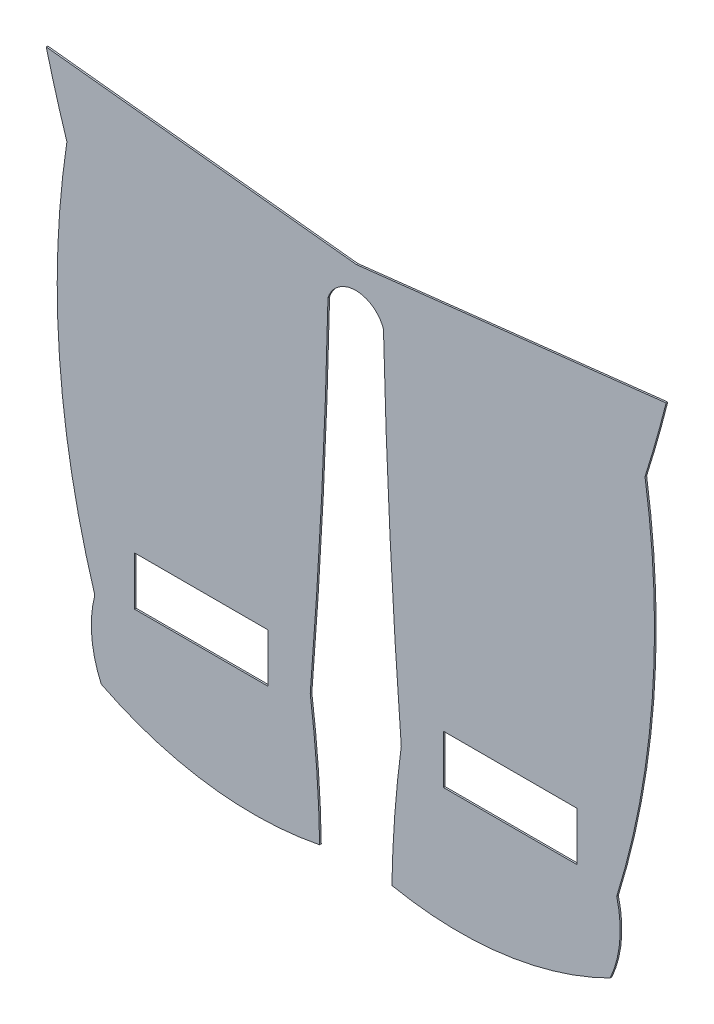
ISO-10303-21;
HEADER;
FILE_DESCRIPTION(('STEP AP214'),'2;1');
FILE_NAME('part.step','',(''),(''),'','','');
FILE_SCHEMA(('AUTOMOTIVE_DESIGN { 1 0 10303 214 1 1 1 1 }'));
ENDSEC;
DATA;
#1=APPLICATION_CONTEXT('core data for automotive mechanical design processes');
#2=APPLICATION_PROTOCOL_DEFINITION('international standard','automotive_design',2000,#1);
#3=PRODUCT_CONTEXT('',#1,'mechanical');
#4=PRODUCT('Part','Part','',(#3));
#5=PRODUCT_RELATED_PRODUCT_CATEGORY('part','',(#4));
#6=PRODUCT_DEFINITION_FORMATION('','',#4);
#7=PRODUCT_DEFINITION_CONTEXT('part definition',#1,'design');
#8=PRODUCT_DEFINITION('design','',#6,#7);
#9=PRODUCT_DEFINITION_SHAPE('','',#8);
#10=(LENGTH_UNIT() NAMED_UNIT(*) SI_UNIT(.MILLI.,.METRE.));
#11=(NAMED_UNIT(*) PLANE_ANGLE_UNIT() SI_UNIT($,.RADIAN.));
#12=(NAMED_UNIT(*) SI_UNIT($,.STERADIAN.) SOLID_ANGLE_UNIT());
#13=UNCERTAINTY_MEASURE_WITH_UNIT(LENGTH_MEASURE(1.E-05),#10,'distance_accuracy_value','');
#14=(GEOMETRIC_REPRESENTATION_CONTEXT(3) GLOBAL_UNCERTAINTY_ASSIGNED_CONTEXT((#13)) GLOBAL_UNIT_ASSIGNED_CONTEXT((#10,
#11,#12)) REPRESENTATION_CONTEXT('',''));
#15=CARTESIAN_POINT('',(0.,0.,0.));
#16=DIRECTION('',(0.,0.,1.));
#17=DIRECTION('',(1.,0.,0.));
#18=AXIS2_PLACEMENT_3D('',#15,#16,#17);
#19=CARTESIAN_POINT('',(107.513003913348,-30.1218571885523,0.1));
#20=DIRECTION('',(0.,0.,1.));
#21=DIRECTION('',(1.,0.,0.));
#22=AXIS2_PLACEMENT_3D('',#19,#20,#21);
#23=PLANE('',#22);
#24=CARTESIAN_POINT('',(107.513003913348,-30.1218571885523,0.1));
#25=DIRECTION('',(0.,0.,1.));
#26=DIRECTION('',(1.,0.,0.));
#27=AXIS2_PLACEMENT_3D('',#24,#25,#26);
#28=CIRCLE('',#27,67.2087371962393);
#29=CARTESIAN_POINT('',(40.8915086534505,-21.2567161942628,0.1));
#30=VERTEX_POINT('',#29);
#31=CARTESIAN_POINT('',(40.3143128244383,-28.9598453768816,0.1));
#32=VERTEX_POINT('',#31);
#33=EDGE_CURVE('E255',#30,#32,#28,.T.);
#34=ORIENTED_EDGE('',*,*,#33,.T.);
#35=CARTESIAN_POINT('',(44.4432126529051,-8.62989328623254,0.1));
#36=DIRECTION('',(0.,0.,1.));
#37=DIRECTION('',(1.,0.,0.));
#38=AXIS2_PLACEMENT_3D('',#35,#36,#37);
#39=CIRCLE('',#38,20.7449937527491);
#40=CARTESIAN_POINT('',(53.7414393050201,-27.1743735142545,0.1));
#41=VERTEX_POINT('',#40);
#42=EDGE_CURVE('E258',#32,#41,#39,.T.);
#43=ORIENTED_EDGE('',*,*,#42,.T.);
#44=CARTESIAN_POINT('',(47.442155933447,-24.3281402727975,0.1));
#45=DIRECTION('',(0.,0.,1.));
#46=DIRECTION('',(1.,0.,0.));
#47=AXIS2_PLACEMENT_3D('',#44,#45,#46);
#48=CIRCLE('',#47,6.91245359189859);
#49=CARTESIAN_POINT('',(54.1415674137631,-22.6252308572496,0.1));
#50=VERTEX_POINT('',#49);
#51=EDGE_CURVE('E261',#41,#50,#48,.T.);
#52=ORIENTED_EDGE('',*,*,#51,.T.);
#53=CARTESIAN_POINT('',(4.16295016537832,-7.20259593469375,0.1));
#54=DIRECTION('',(0.,0.,1.));
#55=DIRECTION('',(1.,0.,0.));
#56=AXIS2_PLACEMENT_3D('',#53,#54,#55);
#57=CIRCLE('',#56,52.3041093033327);
#58=CARTESIAN_POINT('',(55.8820234086865,0.598513785615588,0.1));
#59=VERTEX_POINT('',#58);
#60=EDGE_CURVE('E263',#50,#59,#57,.T.);
#61=ORIENTED_EDGE('',*,*,#60,.T.);
#62=CARTESIAN_POINT('',(-22.2255408120811,25.2302523238041,0.1));
#63=DIRECTION('',(0.,0.,1.));
#64=DIRECTION('',(1.,0.,0.));
#65=AXIS2_PLACEMENT_3D('',#62,#63,#64);
#66=CIRCLE('',#65,81.8994147226646);
#67=CARTESIAN_POINT('',(57.1799278092227,5.17319159831001,0.1));
#68=VERTEX_POINT('',#67);
#69=EDGE_CURVE('E265',#59,#68,#66,.T.);
#70=ORIENTED_EDGE('',*,*,#69,.T.);
#71=DIRECTION('',(-0.993663723846832,-0.11239396741305,0.));
#72=VECTOR('',#71,1.);
#73=CARTESIAN_POINT('',(38.1333314379311,3.01881836266757,0.1));
#74=LINE('',#73,#72);
#75=CARTESIAN_POINT('',(38.1333314379311,3.01881836266757,0.1));
#76=VERTEX_POINT('',#75);
#77=EDGE_CURVE('E267',#68,#76,#74,.T.);
#78=ORIENTED_EDGE('',*,*,#77,.T.);
#79=DIRECTION('',(-0.994255428706461,0.107033370907073,0.));
#80=VECTOR('',#79,1.);
#81=CARTESIAN_POINT('',(19.0574821392629,5.07236757587945,0.1));
#82=LINE('',#81,#80);
#83=CARTESIAN_POINT('',(19.0574821392629,5.07236757587945,0.1));
#84=VERTEX_POINT('',#83);
#85=EDGE_CURVE('E269',#76,#84,#82,.T.);
#86=ORIENTED_EDGE('',*,*,#85,.T.);
#87=CARTESIAN_POINT('',(89.8499317339794,23.0606719048557,0.1));
#88=DIRECTION('',(0.,0.,1.));
#89=DIRECTION('',(1.,0.,0.));
#90=AXIS2_PLACEMENT_3D('',#87,#88,#89);
#91=CIRCLE('',#90,73.0421112253223);
#92=CARTESIAN_POINT('',(20.3281128591151,0.658290054192934,0.1));
#93=VERTEX_POINT('',#92);
#94=EDGE_CURVE('E271',#84,#93,#91,.T.);
#95=ORIENTED_EDGE('',*,*,#94,.T.);
#96=CARTESIAN_POINT('',(72.170078260082,-7.23106685208995,0.1));
#97=DIRECTION('',(0.,0.,1.));
#98=DIRECTION('',(1.,0.,0.));
#99=AXIS2_PLACEMENT_3D('',#96,#97,#98);
#100=CIRCLE('',#99,52.4388341692468);
#101=CARTESIAN_POINT('',(22.0424441582349,-22.6275478909864,0.1));
#102=VERTEX_POINT('',#101);
#103=EDGE_CURVE('E273',#93,#102,#100,.T.);
#104=ORIENTED_EDGE('',*,*,#103,.T.);
#105=CARTESIAN_POINT('',(28.7419382651735,-24.3295044845207,0.1));
#106=DIRECTION('',(0.,0.,1.));
#107=DIRECTION('',(1.,0.,0.));
#108=AXIS2_PLACEMENT_3D('',#105,#106,#107);
#109=CIRCLE('',#108,6.9122990050475);
#110=CARTESIAN_POINT('',(22.4431844450191,-27.1765341380844,0.1));
#111=VERTEX_POINT('',#110);
#112=EDGE_CURVE('E275',#102,#111,#109,.T.);
#113=ORIENTED_EDGE('',*,*,#112,.T.);
#114=CARTESIAN_POINT('',(31.8198731199193,-8.67160303052282,0.1));
#115=DIRECTION('',(0.,0.,1.));
#116=DIRECTION('',(1.,0.,0.));
#117=AXIS2_PLACEMENT_3D('',#114,#115,#116);
#118=CIRCLE('',#117,20.7449937527491);
#119=CARTESIAN_POINT('',(35.8714351392091,-29.0171089471976,0.1));
#120=VERTEX_POINT('',#119);
#121=EDGE_CURVE('E277',#111,#120,#118,.T.);
#122=ORIENTED_EDGE('',*,*,#121,.T.);
#123=CARTESIAN_POINT('',(-31.3276129714269,-30.1309294972006,0.1));
#124=DIRECTION('',(0.,0.,1.));
#125=DIRECTION('',(1.,0.,0.));
#126=AXIS2_PLACEMENT_3D('',#123,#124,#125);
#127=CIRCLE('',#126,67.2082782341073);
#128=CARTESIAN_POINT('',(35.292291091325,-21.2573143453631,0.1));
#129=VERTEX_POINT('',#128);
#130=EDGE_CURVE('E279',#120,#129,#127,.T.);
#131=ORIENTED_EDGE('',*,*,#130,.T.);
#132=CARTESIAN_POINT('',(-340.455747322751,8.53305658808496,0.1));
#133=DIRECTION('',(0.,0.,1.));
#134=DIRECTION('',(1.,0.,0.));
#135=AXIS2_PLACEMENT_3D('',#132,#133,#134);
#136=CIRCLE('',#135,376.927121035855);
#137=CARTESIAN_POINT('',(36.3831503836232,0.378318834904858,0.1));
#138=VERTEX_POINT('',#137);
#139=EDGE_CURVE('E281',#129,#138,#136,.T.);
#140=ORIENTED_EDGE('',*,*,#139,.T.);
#141=CARTESIAN_POINT('',(38.0958401757753,-0.179200821452936,0.1));
#142=DIRECTION('',(0.,0.,-1.));
#143=DIRECTION('',(1.,0.,0.));
#144=AXIS2_PLACEMENT_3D('',#141,#142,#143);
#145=CIRCLE('',#144,1.80114810367375);
#146=CARTESIAN_POINT('',(39.796709943411,0.413400667669931,0.1));
#147=VERTEX_POINT('',#146);
#148=EDGE_CURVE('E283',#138,#147,#145,.T.);
#149=ORIENTED_EDGE('',*,*,#148,.T.);
#150=CARTESIAN_POINT('',(446.109151641794,10.0780491726186,0.1));
#151=DIRECTION('',(0.,0.,1.));
#152=DIRECTION('',(1.,0.,0.));
#153=AXIS2_PLACEMENT_3D('',#150,#151,#152);
#154=CIRCLE('',#153,406.427368307828);
#155=EDGE_CURVE('E285',#147,#30,#154,.T.);
#156=ORIENTED_EDGE('',*,*,#155,.T.);
#157=EDGE_LOOP('',(#34,#43,#52,#61,#70,#78,#86,#95,#104,#113,#122,#131,#140,#149,#156));
#158=FACE_BOUND('',#157,.T.);
#159=DIRECTION('',(-1.,0.,0.));
#160=VECTOR('',#159,1.);
#161=CARTESIAN_POINT('',(24.4900417797415,-19.1572976719763,0.1));
#162=LINE('',#161,#160);
#163=CARTESIAN_POINT('',(32.6900417797415,-19.1572976719763,0.1));
#164=VERTEX_POINT('',#163);
#165=CARTESIAN_POINT('',(24.4900417797415,-19.1572976719763,0.1));
#166=VERTEX_POINT('',#165);
#167=EDGE_CURVE('E226',#164,#166,#162,.T.);
#168=ORIENTED_EDGE('',*,*,#167,.F.);
#169=DIRECTION('',(0.,1.,0.));
#170=VECTOR('',#169,1.);
#171=CARTESIAN_POINT('',(32.6900417797415,-19.1572976719763,0.1));
#172=LINE('',#171,#170);
#173=CARTESIAN_POINT('',(32.6900417797415,-22.1572976719763,0.1));
#174=VERTEX_POINT('',#173);
#175=EDGE_CURVE('E224',#174,#164,#172,.T.);
#176=ORIENTED_EDGE('',*,*,#175,.F.);
#177=DIRECTION('',(1.,0.,0.));
#178=VECTOR('',#177,1.);
#179=CARTESIAN_POINT('',(32.6900417797415,-22.1572976719763,0.1));
#180=LINE('',#179,#178);
#181=CARTESIAN_POINT('',(24.4900417797416,-22.1572976719763,0.1));
#182=VERTEX_POINT('',#181);
#183=EDGE_CURVE('E232',#182,#174,#180,.T.);
#184=ORIENTED_EDGE('',*,*,#183,.F.);
#185=DIRECTION('',(0.,-1.,0.));
#186=VECTOR('',#185,1.);
#187=CARTESIAN_POINT('',(24.4900417797415,-22.1572976719763,0.1));
#188=LINE('',#187,#186);
#189=EDGE_CURVE('E229',#166,#182,#188,.T.);
#190=ORIENTED_EDGE('',*,*,#189,.F.);
#191=EDGE_LOOP('',(#168,#176,#184,#190));
#192=FACE_BOUND('',#191,.T.);
#193=DIRECTION('',(-1.,0.,0.));
#194=VECTOR('',#193,1.);
#195=CARTESIAN_POINT('',(43.4900417797416,-19.1572976719763,0.1));
#196=LINE('',#195,#194);
#197=CARTESIAN_POINT('',(51.6900417797415,-19.1572976719763,0.1));
#198=VERTEX_POINT('',#197);
#199=CARTESIAN_POINT('',(43.4900417797416,-19.1572976719763,0.1));
#200=VERTEX_POINT('',#199);
#201=EDGE_CURVE('E196',#198,#200,#196,.T.);
#202=ORIENTED_EDGE('',*,*,#201,.F.);
#203=DIRECTION('',(0.,1.,0.));
#204=VECTOR('',#203,1.);
#205=CARTESIAN_POINT('',(51.6900417797415,-19.1572976719763,0.1));
#206=LINE('',#205,#204);
#207=CARTESIAN_POINT('',(51.6900417797415,-22.1572976719763,0.1));
#208=VERTEX_POINT('',#207);
#209=EDGE_CURVE('E188',#208,#198,#206,.T.);
#210=ORIENTED_EDGE('',*,*,#209,.F.);
#211=DIRECTION('',(1.,0.,0.));
#212=VECTOR('',#211,1.);
#213=CARTESIAN_POINT('',(51.6900417797415,-22.1572976719763,0.1));
#214=LINE('',#213,#212);
#215=CARTESIAN_POINT('',(43.4900417797416,-22.1572976719763,0.1));
#216=VERTEX_POINT('',#215);
#217=EDGE_CURVE('E210',#216,#208,#214,.T.);
#218=ORIENTED_EDGE('',*,*,#217,.F.);
#219=DIRECTION('',(0.,-1.,0.));
#220=VECTOR('',#219,1.);
#221=CARTESIAN_POINT('',(43.4900417797416,-22.1572976719763,0.1));
#222=LINE('',#221,#220);
#223=EDGE_CURVE('E208',#200,#216,#222,.T.);
#224=ORIENTED_EDGE('',*,*,#223,.F.);
#225=EDGE_LOOP('',(#202,#210,#218,#224));
#226=FACE_BOUND('',#225,.T.);
#227=ADVANCED_FACE('F33',(#158,#192,#226),#23,.T.);
#228=CARTESIAN_POINT('',(107.513003913348,-30.1218571885523,0.));
#229=DIRECTION('',(0.,0.,1.));
#230=DIRECTION('',(1.,0.,0.));
#231=AXIS2_PLACEMENT_3D('',#228,#229,#230);
#232=PLANE('',#231);
#233=DIRECTION('',(0.,1.,0.));
#234=VECTOR('',#233,1.);
#235=CARTESIAN_POINT('',(32.6900417797415,-19.1572976719763,0.));
#236=LINE('',#235,#234);
#237=CARTESIAN_POINT('',(32.6900417797415,-22.1572976719763,0.));
#238=VERTEX_POINT('',#237);
#239=CARTESIAN_POINT('',(32.6900417797415,-19.1572976719763,0.));
#240=VERTEX_POINT('',#239);
#241=EDGE_CURVE('E204',#238,#240,#236,.T.);
#242=ORIENTED_EDGE('',*,*,#241,.T.);
#243=DIRECTION('',(-1.,0.,0.));
#244=VECTOR('',#243,1.);
#245=CARTESIAN_POINT('',(24.4900417797415,-19.1572976719763,0.));
#246=LINE('',#245,#244);
#247=CARTESIAN_POINT('',(24.4900417797415,-19.1572976719763,0.));
#248=VERTEX_POINT('',#247);
#249=EDGE_CURVE('E237',#240,#248,#246,.T.);
#250=ORIENTED_EDGE('',*,*,#249,.T.);
#251=DIRECTION('',(0.,-1.,0.));
#252=VECTOR('',#251,1.);
#253=CARTESIAN_POINT('',(24.4900417797415,-22.1572976719763,0.));
#254=LINE('',#253,#252);
#255=CARTESIAN_POINT('',(24.4900417797415,-22.1572976719763,0.));
#256=VERTEX_POINT('',#255);
#257=EDGE_CURVE('E240',#248,#256,#254,.T.);
#258=ORIENTED_EDGE('',*,*,#257,.T.);
#259=DIRECTION('',(1.,0.,0.));
#260=VECTOR('',#259,1.);
#261=CARTESIAN_POINT('',(32.6900417797415,-22.1572976719763,0.));
#262=LINE('',#261,#260);
#263=EDGE_CURVE('E227',#256,#238,#262,.T.);
#264=ORIENTED_EDGE('',*,*,#263,.T.);
#265=EDGE_LOOP('',(#242,#250,#258,#264));
#266=FACE_BOUND('',#265,.T.);
#267=CARTESIAN_POINT('',(107.513003913348,-30.1218571885523,0.));
#268=DIRECTION('',(0.,0.,1.));
#269=DIRECTION('',(1.,0.,0.));
#270=AXIS2_PLACEMENT_3D('',#267,#268,#269);
#271=CIRCLE('',#270,67.2087371962393);
#272=CARTESIAN_POINT('',(40.8915086534505,-21.2567161942628,0.));
#273=VERTEX_POINT('',#272);
#274=CARTESIAN_POINT('',(40.3143128244383,-28.9598453768816,0.));
#275=VERTEX_POINT('',#274);
#276=EDGE_CURVE('E254',#273,#275,#271,.T.);
#277=ORIENTED_EDGE('',*,*,#276,.F.);
#278=CARTESIAN_POINT('',(446.109151641794,10.0780491726186,0.));
#279=DIRECTION('',(0.,0.,1.));
#280=DIRECTION('',(1.,0.,0.));
#281=AXIS2_PLACEMENT_3D('',#278,#279,#280);
#282=CIRCLE('',#281,406.427368307828);
#283=CARTESIAN_POINT('',(39.796709943411,0.413400667669931,0.));
#284=VERTEX_POINT('',#283);
#285=EDGE_CURVE('E259',#284,#273,#282,.T.);
#286=ORIENTED_EDGE('',*,*,#285,.F.);
#287=CARTESIAN_POINT('',(38.0958401757753,-0.179200821452936,0.));
#288=DIRECTION('',(0.,0.,-1.));
#289=DIRECTION('',(1.,0.,0.));
#290=AXIS2_PLACEMENT_3D('',#287,#288,#289);
#291=CIRCLE('',#290,1.80114810367375);
#292=CARTESIAN_POINT('',(36.3831503836232,0.378318834904858,0.));
#293=VERTEX_POINT('',#292);
#294=EDGE_CURVE('E314',#293,#284,#291,.T.);
#295=ORIENTED_EDGE('',*,*,#294,.F.);
#296=CARTESIAN_POINT('',(-340.455747322751,8.53305658808496,0.));
#297=DIRECTION('',(0.,0.,1.));
#298=DIRECTION('',(1.,0.,0.));
#299=AXIS2_PLACEMENT_3D('',#296,#297,#298);
#300=CIRCLE('',#299,376.927121035855);
#301=CARTESIAN_POINT('',(35.292291091325,-21.2573143453631,0.));
#302=VERTEX_POINT('',#301);
#303=EDGE_CURVE('E312',#302,#293,#300,.T.);
#304=ORIENTED_EDGE('',*,*,#303,.F.);
#305=CARTESIAN_POINT('',(-31.3276129714269,-30.1309294972006,0.));
#306=DIRECTION('',(0.,0.,1.));
#307=DIRECTION('',(1.,0.,0.));
#308=AXIS2_PLACEMENT_3D('',#305,#306,#307);
#309=CIRCLE('',#308,67.2082782341073);
#310=CARTESIAN_POINT('',(35.8714351392091,-29.0171089471976,0.));
#311=VERTEX_POINT('',#310);
#312=EDGE_CURVE('E310',#311,#302,#309,.T.);
#313=ORIENTED_EDGE('',*,*,#312,.F.);
#314=CARTESIAN_POINT('',(31.8198731199193,-8.67160303052282,0.));
#315=DIRECTION('',(0.,0.,1.));
#316=DIRECTION('',(1.,0.,0.));
#317=AXIS2_PLACEMENT_3D('',#314,#315,#316);
#318=CIRCLE('',#317,20.7449937527491);
#319=CARTESIAN_POINT('',(22.4431844450191,-27.1765341380844,0.));
#320=VERTEX_POINT('',#319);
#321=EDGE_CURVE('E308',#320,#311,#318,.T.);
#322=ORIENTED_EDGE('',*,*,#321,.F.);
#323=CARTESIAN_POINT('',(28.7419382651735,-24.3295044845207,0.));
#324=DIRECTION('',(0.,0.,1.));
#325=DIRECTION('',(1.,0.,0.));
#326=AXIS2_PLACEMENT_3D('',#323,#324,#325);
#327=CIRCLE('',#326,6.9122990050475);
#328=CARTESIAN_POINT('',(22.0424441582349,-22.6275478909864,0.));
#329=VERTEX_POINT('',#328);
#330=EDGE_CURVE('E306',#329,#320,#327,.T.);
#331=ORIENTED_EDGE('',*,*,#330,.F.);
#332=CARTESIAN_POINT('',(72.170078260082,-7.23106685208995,0.));
#333=DIRECTION('',(0.,0.,1.));
#334=DIRECTION('',(1.,0.,0.));
#335=AXIS2_PLACEMENT_3D('',#332,#333,#334);
#336=CIRCLE('',#335,52.4388341692468);
#337=CARTESIAN_POINT('',(20.3281128591151,0.658290054192934,0.));
#338=VERTEX_POINT('',#337);
#339=EDGE_CURVE('E304',#338,#329,#336,.T.);
#340=ORIENTED_EDGE('',*,*,#339,.F.);
#341=CARTESIAN_POINT('',(89.8499317339794,23.0606719048557,0.));
#342=DIRECTION('',(0.,0.,1.));
#343=DIRECTION('',(1.,0.,0.));
#344=AXIS2_PLACEMENT_3D('',#341,#342,#343);
#345=CIRCLE('',#344,73.0421112253223);
#346=CARTESIAN_POINT('',(19.0574821392629,5.07236757587945,0.));
#347=VERTEX_POINT('',#346);
#348=EDGE_CURVE('E302',#347,#338,#345,.T.);
#349=ORIENTED_EDGE('',*,*,#348,.F.);
#350=DIRECTION('',(-0.994255428706461,0.107033370907073,0.));
#351=VECTOR('',#350,1.);
#352=CARTESIAN_POINT('',(19.0574821392629,5.07236757587945,0.));
#353=LINE('',#352,#351);
#354=CARTESIAN_POINT('',(38.1333314379311,3.01881836266757,0.));
#355=VERTEX_POINT('',#354);
#356=EDGE_CURVE('E300',#355,#347,#353,.T.);
#357=ORIENTED_EDGE('',*,*,#356,.F.);
#358=DIRECTION('',(-0.993663723846832,-0.11239396741305,0.));
#359=VECTOR('',#358,1.);
#360=CARTESIAN_POINT('',(38.1333314379311,3.01881836266757,0.));
#361=LINE('',#360,#359);
#362=CARTESIAN_POINT('',(57.1799278092227,5.17319159831001,0.));
#363=VERTEX_POINT('',#362);
#364=EDGE_CURVE('E298',#363,#355,#361,.T.);
#365=ORIENTED_EDGE('',*,*,#364,.F.);
#366=CARTESIAN_POINT('',(-22.2255408120811,25.2302523238041,0.));
#367=DIRECTION('',(0.,0.,1.));
#368=DIRECTION('',(1.,0.,0.));
#369=AXIS2_PLACEMENT_3D('',#366,#367,#368);
#370=CIRCLE('',#369,81.8994147226646);
#371=CARTESIAN_POINT('',(55.8820234086865,0.598513785615588,0.));
#372=VERTEX_POINT('',#371);
#373=EDGE_CURVE('E296',#372,#363,#370,.T.);
#374=ORIENTED_EDGE('',*,*,#373,.F.);
#375=CARTESIAN_POINT('',(4.16295016537832,-7.20259593469375,0.));
#376=DIRECTION('',(0.,0.,1.));
#377=DIRECTION('',(1.,0.,0.));
#378=AXIS2_PLACEMENT_3D('',#375,#376,#377);
#379=CIRCLE('',#378,52.3041093033327);
#380=CARTESIAN_POINT('',(54.1415674137631,-22.6252308572496,0.));
#381=VERTEX_POINT('',#380);
#382=EDGE_CURVE('E294',#381,#372,#379,.T.);
#383=ORIENTED_EDGE('',*,*,#382,.F.);
#384=CARTESIAN_POINT('',(47.442155933447,-24.3281402727975,0.));
#385=DIRECTION('',(0.,0.,1.));
#386=DIRECTION('',(1.,0.,0.));
#387=AXIS2_PLACEMENT_3D('',#384,#385,#386);
#388=CIRCLE('',#387,6.91245359189859);
#389=CARTESIAN_POINT('',(53.7414393050201,-27.1743735142545,0.));
#390=VERTEX_POINT('',#389);
#391=EDGE_CURVE('E292',#390,#381,#388,.T.);
#392=ORIENTED_EDGE('',*,*,#391,.F.);
#393=CARTESIAN_POINT('',(44.4432126529051,-8.62989328623254,0.));
#394=DIRECTION('',(0.,0.,1.));
#395=DIRECTION('',(1.,0.,0.));
#396=AXIS2_PLACEMENT_3D('',#393,#394,#395);
#397=CIRCLE('',#396,20.7449937527491);
#398=EDGE_CURVE('E290',#275,#390,#397,.T.);
#399=ORIENTED_EDGE('',*,*,#398,.F.);
#400=EDGE_LOOP('',(#277,#286,#295,#304,#313,#322,#331,#340,#349,#357,#365,#374,#383,#392,#399));
#401=FACE_BOUND('',#400,.T.);
#402=DIRECTION('',(0.,1.,0.));
#403=VECTOR('',#402,1.);
#404=CARTESIAN_POINT('',(51.6900417797415,-19.1572976719763,0.));
#405=LINE('',#404,#403);
#406=CARTESIAN_POINT('',(51.6900417797415,-22.1572976719763,0.));
#407=VERTEX_POINT('',#406);
#408=CARTESIAN_POINT('',(51.6900417797415,-19.1572976719763,0.));
#409=VERTEX_POINT('',#408);
#410=EDGE_CURVE('E56',#407,#409,#405,.T.);
#411=ORIENTED_EDGE('',*,*,#410,.T.);
#412=DIRECTION('',(-1.,0.,0.));
#413=VECTOR('',#412,1.);
#414=CARTESIAN_POINT('',(43.4900417797416,-19.1572976719763,0.));
#415=LINE('',#414,#413);
#416=CARTESIAN_POINT('',(43.4900417797416,-19.1572976719763,0.));
#417=VERTEX_POINT('',#416);
#418=EDGE_CURVE('E203',#409,#417,#415,.T.);
#419=ORIENTED_EDGE('',*,*,#418,.T.);
#420=DIRECTION('',(0.,-1.,0.));
#421=VECTOR('',#420,1.);
#422=CARTESIAN_POINT('',(43.4900417797416,-22.1572976719763,0.));
#423=LINE('',#422,#421);
#424=CARTESIAN_POINT('',(43.4900417797416,-22.1572976719763,0.));
#425=VERTEX_POINT('',#424);
#426=EDGE_CURVE('E216',#417,#425,#423,.T.);
#427=ORIENTED_EDGE('',*,*,#426,.T.);
#428=DIRECTION('',(1.,0.,0.));
#429=VECTOR('',#428,1.);
#430=CARTESIAN_POINT('',(51.6900417797415,-22.1572976719763,0.));
#431=LINE('',#430,#429);
#432=EDGE_CURVE('E197',#425,#407,#431,.T.);
#433=ORIENTED_EDGE('',*,*,#432,.T.);
#434=EDGE_LOOP('',(#411,#419,#427,#433));
#435=FACE_BOUND('',#434,.T.);
#436=ADVANCED_FACE('F365',(#266,#401,#435),#232,.F.);
#437=CARTESIAN_POINT('',(107.513003913348,-30.1218571885523,0.1));
#438=DIRECTION('',(0.,0.,-1.));
#439=DIRECTION('',(-1.,0.,0.));
#440=AXIS2_PLACEMENT_3D('',#437,#438,#439);
#441=CYLINDRICAL_SURFACE('',#440,67.2087371962393);
#442=ORIENTED_EDGE('',*,*,#276,.T.);
#443=DIRECTION('',(0.,0.,-1.));
#444=VECTOR('',#443,1.);
#445=CARTESIAN_POINT('',(40.3143128244383,-28.9598453768816,0.1));
#446=LINE('',#445,#444);
#447=EDGE_CURVE('E11',#32,#275,#446,.T.);
#448=ORIENTED_EDGE('',*,*,#447,.F.);
#449=ORIENTED_EDGE('',*,*,#33,.F.);
#450=DIRECTION('',(0.,0.,-1.));
#451=VECTOR('',#450,1.);
#452=CARTESIAN_POINT('',(40.8915086534505,-21.2567161942628,0.1));
#453=LINE('',#452,#451);
#454=EDGE_CURVE('E287',#30,#273,#453,.T.);
#455=ORIENTED_EDGE('',*,*,#454,.T.);
#456=EDGE_LOOP('',(#442,#448,#449,#455));
#457=FACE_BOUND('',#456,.T.);
#458=ADVANCED_FACE('F35',(#457),#441,.T.);
#459=CARTESIAN_POINT('',(44.4432126529051,-8.62989328623254,0.1));
#460=DIRECTION('',(0.,0.,-1.));
#461=DIRECTION('',(-1.,0.,0.));
#462=AXIS2_PLACEMENT_3D('',#459,#460,#461);
#463=CYLINDRICAL_SURFACE('',#462,20.7449937527491);
#464=ORIENTED_EDGE('',*,*,#398,.T.);
#465=DIRECTION('',(0.,0.,-1.));
#466=VECTOR('',#465,1.);
#467=CARTESIAN_POINT('',(53.7414393050201,-27.1743735142545,0.1));
#468=LINE('',#467,#466);
#469=EDGE_CURVE('E41',#41,#390,#468,.T.);
#470=ORIENTED_EDGE('',*,*,#469,.F.);
#471=ORIENTED_EDGE('',*,*,#42,.F.);
#472=ORIENTED_EDGE('',*,*,#447,.T.);
#473=EDGE_LOOP('',(#464,#470,#471,#472));
#474=FACE_BOUND('',#473,.T.);
#475=ADVANCED_FACE('F383',(#474),#463,.T.);
#476=CARTESIAN_POINT('',(47.442155933447,-24.3281402727975,0.1));
#477=DIRECTION('',(0.,0.,-1.));
#478=DIRECTION('',(-1.,0.,0.));
#479=AXIS2_PLACEMENT_3D('',#476,#477,#478);
#480=CYLINDRICAL_SURFACE('',#479,6.91245359189859);
#481=ORIENTED_EDGE('',*,*,#391,.T.);
#482=DIRECTION('',(0.,0.,-1.));
#483=VECTOR('',#482,1.);
#484=CARTESIAN_POINT('',(54.1415674137631,-22.6252308572496,0.1));
#485=LINE('',#484,#483);
#486=EDGE_CURVE('E352',#50,#381,#485,.T.);
#487=ORIENTED_EDGE('',*,*,#486,.F.);
#488=ORIENTED_EDGE('',*,*,#51,.F.);
#489=ORIENTED_EDGE('',*,*,#469,.T.);
#490=EDGE_LOOP('',(#481,#487,#488,#489));
#491=FACE_BOUND('',#490,.T.);
#492=ADVANCED_FACE('F359',(#491),#480,.T.);
#493=CARTESIAN_POINT('',(4.16295016537832,-7.20259593469375,0.1));
#494=DIRECTION('',(0.,0.,-1.));
#495=DIRECTION('',(-1.,0.,0.));
#496=AXIS2_PLACEMENT_3D('',#493,#494,#495);
#497=CYLINDRICAL_SURFACE('',#496,52.3041093033327);
#498=ORIENTED_EDGE('',*,*,#382,.T.);
#499=DIRECTION('',(0.,0.,-1.));
#500=VECTOR('',#499,1.);
#501=CARTESIAN_POINT('',(55.8820234086865,0.598513785615588,0.1));
#502=LINE('',#501,#500);
#503=EDGE_CURVE('E349',#59,#372,#502,.T.);
#504=ORIENTED_EDGE('',*,*,#503,.F.);
#505=ORIENTED_EDGE('',*,*,#60,.F.);
#506=ORIENTED_EDGE('',*,*,#486,.T.);
#507=EDGE_LOOP('',(#498,#504,#505,#506));
#508=FACE_BOUND('',#507,.T.);
#509=ADVANCED_FACE('F371',(#508),#497,.T.);
#510=CARTESIAN_POINT('',(-22.2255408120811,25.2302523238041,0.1));
#511=DIRECTION('',(0.,0.,-1.));
#512=DIRECTION('',(-1.,0.,0.));
#513=AXIS2_PLACEMENT_3D('',#510,#511,#512);
#514=CYLINDRICAL_SURFACE('',#513,81.8994147226646);
#515=ORIENTED_EDGE('',*,*,#373,.T.);
#516=DIRECTION('',(0.,0.,-1.));
#517=VECTOR('',#516,1.);
#518=CARTESIAN_POINT('',(57.1799278092227,5.17319159831001,0.1));
#519=LINE('',#518,#517);
#520=EDGE_CURVE('E346',#68,#363,#519,.T.);
#521=ORIENTED_EDGE('',*,*,#520,.F.);
#522=ORIENTED_EDGE('',*,*,#69,.F.);
#523=ORIENTED_EDGE('',*,*,#503,.T.);
#524=EDGE_LOOP('',(#515,#521,#522,#523));
#525=FACE_BOUND('',#524,.T.);
#526=ADVANCED_FACE('F375',(#525),#514,.T.);
#527=CARTESIAN_POINT('',(38.1333314379311,3.01881836266757,0.1));
#528=DIRECTION('',(0.11239396741305,-0.993663723846833,0.));
#529=DIRECTION('',(0.993663723846833,0.11239396741305,0.));
#530=AXIS2_PLACEMENT_3D('',#527,#528,#529);
#531=PLANE('',#530);
#532=ORIENTED_EDGE('',*,*,#364,.T.);
#533=DIRECTION('',(0.,0.,-1.));
#534=VECTOR('',#533,1.);
#535=CARTESIAN_POINT('',(38.1333314379311,3.01881836266757,0.1));
#536=LINE('',#535,#534);
#537=EDGE_CURVE('E343',#76,#355,#536,.T.);
#538=ORIENTED_EDGE('',*,*,#537,.F.);
#539=ORIENTED_EDGE('',*,*,#77,.F.);
#540=ORIENTED_EDGE('',*,*,#520,.T.);
#541=EDGE_LOOP('',(#532,#538,#539,#540));
#542=FACE_BOUND('',#541,.T.);
#543=ADVANCED_FACE('F431',(#542),#531,.F.);
#544=CARTESIAN_POINT('',(19.0574821392629,5.07236757587945,0.1));
#545=DIRECTION('',(-0.107033370907073,-0.994255428706461,0.));
#546=DIRECTION('',(0.994255428706461,-0.107033370907073,0.));
#547=AXIS2_PLACEMENT_3D('',#544,#545,#546);
#548=PLANE('',#547);
#549=ORIENTED_EDGE('',*,*,#356,.T.);
#550=DIRECTION('',(0.,0.,-1.));
#551=VECTOR('',#550,1.);
#552=CARTESIAN_POINT('',(19.0574821392629,5.07236757587945,0.1));
#553=LINE('',#552,#551);
#554=EDGE_CURVE('E340',#84,#347,#553,.T.);
#555=ORIENTED_EDGE('',*,*,#554,.F.);
#556=ORIENTED_EDGE('',*,*,#85,.F.);
#557=ORIENTED_EDGE('',*,*,#537,.T.);
#558=EDGE_LOOP('',(#549,#555,#556,#557));
#559=FACE_BOUND('',#558,.T.);
#560=ADVANCED_FACE('F429',(#559),#548,.F.);
#561=CARTESIAN_POINT('',(89.8499317339794,23.0606719048557,0.1));
#562=DIRECTION('',(0.,0.,-1.));
#563=DIRECTION('',(-1.,0.,0.));
#564=AXIS2_PLACEMENT_3D('',#561,#562,#563);
#565=CYLINDRICAL_SURFACE('',#564,73.0421112253223);
#566=ORIENTED_EDGE('',*,*,#348,.T.);
#567=DIRECTION('',(0.,0.,-1.));
#568=VECTOR('',#567,1.);
#569=CARTESIAN_POINT('',(20.3281128591151,0.658290054192934,0.1));
#570=LINE('',#569,#568);
#571=EDGE_CURVE('E337',#93,#338,#570,.T.);
#572=ORIENTED_EDGE('',*,*,#571,.F.);
#573=ORIENTED_EDGE('',*,*,#94,.F.);
#574=ORIENTED_EDGE('',*,*,#554,.T.);
#575=EDGE_LOOP('',(#566,#572,#573,#574));
#576=FACE_BOUND('',#575,.T.);
#577=ADVANCED_FACE('F425',(#576),#565,.T.);
#578=CARTESIAN_POINT('',(72.170078260082,-7.23106685208995,0.1));
#579=DIRECTION('',(0.,0.,-1.));
#580=DIRECTION('',(-1.,0.,0.));
#581=AXIS2_PLACEMENT_3D('',#578,#579,#580);
#582=CYLINDRICAL_SURFACE('',#581,52.4388341692468);
#583=ORIENTED_EDGE('',*,*,#339,.T.);
#584=DIRECTION('',(0.,0.,-1.));
#585=VECTOR('',#584,1.);
#586=CARTESIAN_POINT('',(22.0424441582349,-22.6275478909864,0.1));
#587=LINE('',#586,#585);
#588=EDGE_CURVE('E334',#102,#329,#587,.T.);
#589=ORIENTED_EDGE('',*,*,#588,.F.);
#590=ORIENTED_EDGE('',*,*,#103,.F.);
#591=ORIENTED_EDGE('',*,*,#571,.T.);
#592=EDGE_LOOP('',(#583,#589,#590,#591));
#593=FACE_BOUND('',#592,.T.);
#594=ADVANCED_FACE('F420',(#593),#582,.T.);
#595=CARTESIAN_POINT('',(28.7419382651735,-24.3295044845207,0.1));
#596=DIRECTION('',(0.,0.,-1.));
#597=DIRECTION('',(-1.,0.,0.));
#598=AXIS2_PLACEMENT_3D('',#595,#596,#597);
#599=CYLINDRICAL_SURFACE('',#598,6.9122990050475);
#600=ORIENTED_EDGE('',*,*,#330,.T.);
#601=DIRECTION('',(0.,0.,-1.));
#602=VECTOR('',#601,1.);
#603=CARTESIAN_POINT('',(22.4431844450191,-27.1765341380844,0.1));
#604=LINE('',#603,#602);
#605=EDGE_CURVE('E331',#111,#320,#604,.T.);
#606=ORIENTED_EDGE('',*,*,#605,.F.);
#607=ORIENTED_EDGE('',*,*,#112,.F.);
#608=ORIENTED_EDGE('',*,*,#588,.T.);
#609=EDGE_LOOP('',(#600,#606,#607,#608));
#610=FACE_BOUND('',#609,.T.);
#611=ADVANCED_FACE('F414',(#610),#599,.T.);
#612=CARTESIAN_POINT('',(31.8198731199193,-8.67160303052282,0.1));
#613=DIRECTION('',(0.,0.,-1.));
#614=DIRECTION('',(-1.,0.,0.));
#615=AXIS2_PLACEMENT_3D('',#612,#613,#614);
#616=CYLINDRICAL_SURFACE('',#615,20.7449937527491);
#617=ORIENTED_EDGE('',*,*,#321,.T.);
#618=DIRECTION('',(0.,0.,-1.));
#619=VECTOR('',#618,1.);
#620=CARTESIAN_POINT('',(35.8714351392091,-29.0171089471976,0.1));
#621=LINE('',#620,#619);
#622=EDGE_CURVE('E328',#120,#311,#621,.T.);
#623=ORIENTED_EDGE('',*,*,#622,.F.);
#624=ORIENTED_EDGE('',*,*,#121,.F.);
#625=ORIENTED_EDGE('',*,*,#605,.T.);
#626=EDGE_LOOP('',(#617,#623,#624,#625));
#627=FACE_BOUND('',#626,.T.);
#628=ADVANCED_FACE('F410',(#627),#616,.T.);
#629=CARTESIAN_POINT('',(-31.3276129714269,-30.1309294972006,0.1));
#630=DIRECTION('',(0.,0.,-1.));
#631=DIRECTION('',(-1.,0.,0.));
#632=AXIS2_PLACEMENT_3D('',#629,#630,#631);
#633=CYLINDRICAL_SURFACE('',#632,67.2082782341073);
#634=ORIENTED_EDGE('',*,*,#312,.T.);
#635=DIRECTION('',(0.,0.,-1.));
#636=VECTOR('',#635,1.);
#637=CARTESIAN_POINT('',(35.292291091325,-21.2573143453631,0.1));
#638=LINE('',#637,#636);
#639=EDGE_CURVE('E325',#129,#302,#638,.T.);
#640=ORIENTED_EDGE('',*,*,#639,.F.);
#641=ORIENTED_EDGE('',*,*,#130,.F.);
#642=ORIENTED_EDGE('',*,*,#622,.T.);
#643=EDGE_LOOP('',(#634,#640,#641,#642));
#644=FACE_BOUND('',#643,.T.);
#645=ADVANCED_FACE('F405',(#644),#633,.T.);
#646=CARTESIAN_POINT('',(-340.455747322751,8.53305658808496,0.1));
#647=DIRECTION('',(0.,0.,-1.));
#648=DIRECTION('',(-1.,0.,0.));
#649=AXIS2_PLACEMENT_3D('',#646,#647,#648);
#650=CYLINDRICAL_SURFACE('',#649,376.927121035855);
#651=ORIENTED_EDGE('',*,*,#303,.T.);
#652=DIRECTION('',(0.,0.,-1.));
#653=VECTOR('',#652,1.);
#654=CARTESIAN_POINT('',(36.3831503836232,0.378318834904858,0.1));
#655=LINE('',#654,#653);
#656=EDGE_CURVE('E322',#138,#293,#655,.T.);
#657=ORIENTED_EDGE('',*,*,#656,.F.);
#658=ORIENTED_EDGE('',*,*,#139,.F.);
#659=ORIENTED_EDGE('',*,*,#639,.T.);
#660=EDGE_LOOP('',(#651,#657,#658,#659));
#661=FACE_BOUND('',#660,.T.);
#662=ADVANCED_FACE('F399',(#661),#650,.T.);
#663=CARTESIAN_POINT('',(38.0958401757753,-0.179200821452936,0.1));
#664=DIRECTION('',(0.,0.,-1.));
#665=DIRECTION('',(-1.,0.,0.));
#666=AXIS2_PLACEMENT_3D('',#663,#664,#665);
#667=CYLINDRICAL_SURFACE('',#666,1.80114810367375);
#668=ORIENTED_EDGE('',*,*,#294,.T.);
#669=DIRECTION('',(0.,0.,-1.));
#670=VECTOR('',#669,1.);
#671=CARTESIAN_POINT('',(39.796709943411,0.413400667669931,0.1));
#672=LINE('',#671,#670);
#673=EDGE_CURVE('E319',#147,#284,#672,.T.);
#674=ORIENTED_EDGE('',*,*,#673,.F.);
#675=ORIENTED_EDGE('',*,*,#148,.F.);
#676=ORIENTED_EDGE('',*,*,#656,.T.);
#677=EDGE_LOOP('',(#668,#674,#675,#676));
#678=FACE_BOUND('',#677,.T.);
#679=ADVANCED_FACE('F395',(#678),#667,.F.);
#680=CARTESIAN_POINT('',(446.109151641794,10.0780491726186,0.1));
#681=DIRECTION('',(0.,0.,-1.));
#682=DIRECTION('',(-1.,0.,0.));
#683=AXIS2_PLACEMENT_3D('',#680,#681,#682);
#684=CYLINDRICAL_SURFACE('',#683,406.427368307828);
#685=ORIENTED_EDGE('',*,*,#285,.T.);
#686=ORIENTED_EDGE('',*,*,#454,.F.);
#687=ORIENTED_EDGE('',*,*,#155,.F.);
#688=ORIENTED_EDGE('',*,*,#673,.T.);
#689=EDGE_LOOP('',(#685,#686,#687,#688));
#690=FACE_BOUND('',#689,.T.);
#691=ADVANCED_FACE('F390',(#690),#684,.T.);
#692=CARTESIAN_POINT('',(32.6900417797415,-19.1572976719763,0.1));
#693=DIRECTION('',(-1.,0.,0.));
#694=DIRECTION('',(0.,0.,1.));
#695=AXIS2_PLACEMENT_3D('',#692,#693,#694);
#696=PLANE('',#695);
#697=ORIENTED_EDGE('',*,*,#241,.F.);
#698=DIRECTION('',(0.,0.,-1.));
#699=VECTOR('',#698,1.);
#700=CARTESIAN_POINT('',(32.6900417797415,-22.1572976719763,0.1));
#701=LINE('',#700,#699);
#702=EDGE_CURVE('E234',#174,#238,#701,.T.);
#703=ORIENTED_EDGE('',*,*,#702,.F.);
#704=ORIENTED_EDGE('',*,*,#175,.T.);
#705=DIRECTION('',(0.,0.,-1.));
#706=VECTOR('',#705,1.);
#707=CARTESIAN_POINT('',(32.6900417797415,-19.1572976719763,0.1));
#708=LINE('',#707,#706);
#709=EDGE_CURVE('E251',#164,#240,#708,.T.);
#710=ORIENTED_EDGE('',*,*,#709,.T.);
#711=EDGE_LOOP('',(#697,#703,#704,#710));
#712=FACE_BOUND('',#711,.T.);
#713=ADVANCED_FACE('F448',(#712),#696,.T.);
#714=CARTESIAN_POINT('',(24.4900417797415,-19.1572976719763,0.1));
#715=DIRECTION('',(0.,-1.,0.));
#716=DIRECTION('',(0.,0.,-1.));
#717=AXIS2_PLACEMENT_3D('',#714,#715,#716);
#718=PLANE('',#717);
#719=ORIENTED_EDGE('',*,*,#249,.F.);
#720=ORIENTED_EDGE('',*,*,#709,.F.);
#721=ORIENTED_EDGE('',*,*,#167,.T.);
#722=DIRECTION('',(0.,0.,-1.));
#723=VECTOR('',#722,1.);
#724=CARTESIAN_POINT('',(24.4900417797415,-19.1572976719763,0.1));
#725=LINE('',#724,#723);
#726=EDGE_CURVE('E249',#166,#248,#725,.T.);
#727=ORIENTED_EDGE('',*,*,#726,.T.);
#728=EDGE_LOOP('',(#719,#720,#721,#727));
#729=FACE_BOUND('',#728,.T.);
#730=ADVANCED_FACE('F504',(#729),#718,.T.);
#731=CARTESIAN_POINT('',(24.4900417797415,-22.1572976719763,0.1));
#732=DIRECTION('',(1.,0.,0.));
#733=DIRECTION('',(0.,0.,-1.));
#734=AXIS2_PLACEMENT_3D('',#731,#732,#733);
#735=PLANE('',#734);
#736=ORIENTED_EDGE('',*,*,#257,.F.);
#737=ORIENTED_EDGE('',*,*,#726,.F.);
#738=ORIENTED_EDGE('',*,*,#189,.T.);
#739=DIRECTION('',(0.,0.,-1.));
#740=VECTOR('',#739,1.);
#741=CARTESIAN_POINT('',(24.4900417797415,-22.1572976719763,0.1));
#742=LINE('',#741,#740);
#743=EDGE_CURVE('E247',#182,#256,#742,.T.);
#744=ORIENTED_EDGE('',*,*,#743,.T.);
#745=EDGE_LOOP('',(#736,#737,#738,#744));
#746=FACE_BOUND('',#745,.T.);
#747=ADVANCED_FACE('F511',(#746),#735,.T.);
#748=CARTESIAN_POINT('',(32.6900417797415,-22.1572976719763,0.1));
#749=DIRECTION('',(0.,1.,0.));
#750=DIRECTION('',(0.,0.,1.));
#751=AXIS2_PLACEMENT_3D('',#748,#749,#750);
#752=PLANE('',#751);
#753=ORIENTED_EDGE('',*,*,#263,.F.);
#754=ORIENTED_EDGE('',*,*,#743,.F.);
#755=ORIENTED_EDGE('',*,*,#183,.T.);
#756=ORIENTED_EDGE('',*,*,#702,.T.);
#757=EDGE_LOOP('',(#753,#754,#755,#756));
#758=FACE_BOUND('',#757,.T.);
#759=ADVANCED_FACE('F518',(#758),#752,.T.);
#760=CARTESIAN_POINT('',(51.6900417797415,-19.1572976719763,0.1));
#761=DIRECTION('',(-1.,0.,0.));
#762=DIRECTION('',(0.,0.,1.));
#763=AXIS2_PLACEMENT_3D('',#760,#761,#762);
#764=PLANE('',#763);
#765=ORIENTED_EDGE('',*,*,#410,.F.);
#766=DIRECTION('',(0.,0.,-1.));
#767=VECTOR('',#766,1.);
#768=CARTESIAN_POINT('',(51.6900417797415,-22.1572976719763,0.1));
#769=LINE('',#768,#767);
#770=EDGE_CURVE('E192',#208,#407,#769,.T.);
#771=ORIENTED_EDGE('',*,*,#770,.F.);
#772=ORIENTED_EDGE('',*,*,#209,.T.);
#773=DIRECTION('',(0.,0.,-1.));
#774=VECTOR('',#773,1.);
#775=CARTESIAN_POINT('',(51.6900417797415,-19.1572976719763,0.1));
#776=LINE('',#775,#774);
#777=EDGE_CURVE('E191',#198,#409,#776,.T.);
#778=ORIENTED_EDGE('',*,*,#777,.T.);
#779=EDGE_LOOP('',(#765,#771,#772,#778));
#780=FACE_BOUND('',#779,.T.);
#781=ADVANCED_FACE('F190',(#780),#764,.T.);
#782=CARTESIAN_POINT('',(43.4900417797416,-19.1572976719763,0.1));
#783=DIRECTION('',(0.,-1.,0.));
#784=DIRECTION('',(0.,0.,-1.));
#785=AXIS2_PLACEMENT_3D('',#782,#783,#784);
#786=PLANE('',#785);
#787=ORIENTED_EDGE('',*,*,#418,.F.);
#788=ORIENTED_EDGE('',*,*,#777,.F.);
#789=ORIENTED_EDGE('',*,*,#201,.T.);
#790=DIRECTION('',(0.,0.,-1.));
#791=VECTOR('',#790,1.);
#792=CARTESIAN_POINT('',(43.4900417797416,-19.1572976719763,0.1));
#793=LINE('',#792,#791);
#794=EDGE_CURVE('E205',#200,#417,#793,.T.);
#795=ORIENTED_EDGE('',*,*,#794,.T.);
#796=EDGE_LOOP('',(#787,#788,#789,#795));
#797=FACE_BOUND('',#796,.T.);
#798=ADVANCED_FACE('F200',(#797),#786,.T.);
#799=CARTESIAN_POINT('',(43.4900417797416,-22.1572976719763,0.1));
#800=DIRECTION('',(1.,0.,0.));
#801=DIRECTION('',(0.,0.,-1.));
#802=AXIS2_PLACEMENT_3D('',#799,#800,#801);
#803=PLANE('',#802);
#804=ORIENTED_EDGE('',*,*,#426,.F.);
#805=ORIENTED_EDGE('',*,*,#794,.F.);
#806=ORIENTED_EDGE('',*,*,#223,.T.);
#807=DIRECTION('',(0.,0.,-1.));
#808=VECTOR('',#807,1.);
#809=CARTESIAN_POINT('',(43.4900417797416,-22.1572976719763,0.1));
#810=LINE('',#809,#808);
#811=EDGE_CURVE('E48',#216,#425,#810,.T.);
#812=ORIENTED_EDGE('',*,*,#811,.T.);
#813=EDGE_LOOP('',(#804,#805,#806,#812));
#814=FACE_BOUND('',#813,.T.);
#815=ADVANCED_FACE('F539',(#814),#803,.T.);
#816=CARTESIAN_POINT('',(51.6900417797415,-22.1572976719763,0.1));
#817=DIRECTION('',(0.,1.,0.));
#818=DIRECTION('',(0.,0.,1.));
#819=AXIS2_PLACEMENT_3D('',#816,#817,#818);
#820=PLANE('',#819);
#821=ORIENTED_EDGE('',*,*,#432,.F.);
#822=ORIENTED_EDGE('',*,*,#811,.F.);
#823=ORIENTED_EDGE('',*,*,#217,.T.);
#824=ORIENTED_EDGE('',*,*,#770,.T.);
#825=EDGE_LOOP('',(#821,#822,#823,#824));
#826=FACE_BOUND('',#825,.T.);
#827=ADVANCED_FACE('F546',(#826),#820,.T.);
#828=CLOSED_SHELL('',(#227,#436,#458,#475,#492,#509,#526,#543,#560,#577,#594,#611,#628,#645,
#662,#679,#691,#713,#730,#747,#759,#781,#798,#815,#827));
#829=MANIFOLD_SOLID_BREP('B2',#828);
#830=ADVANCED_BREP_SHAPE_REPRESENTATION('',(#18,#829),#14);
#831=SHAPE_DEFINITION_REPRESENTATION(#9,#830);
ENDSEC;
END-ISO-10303-21;
